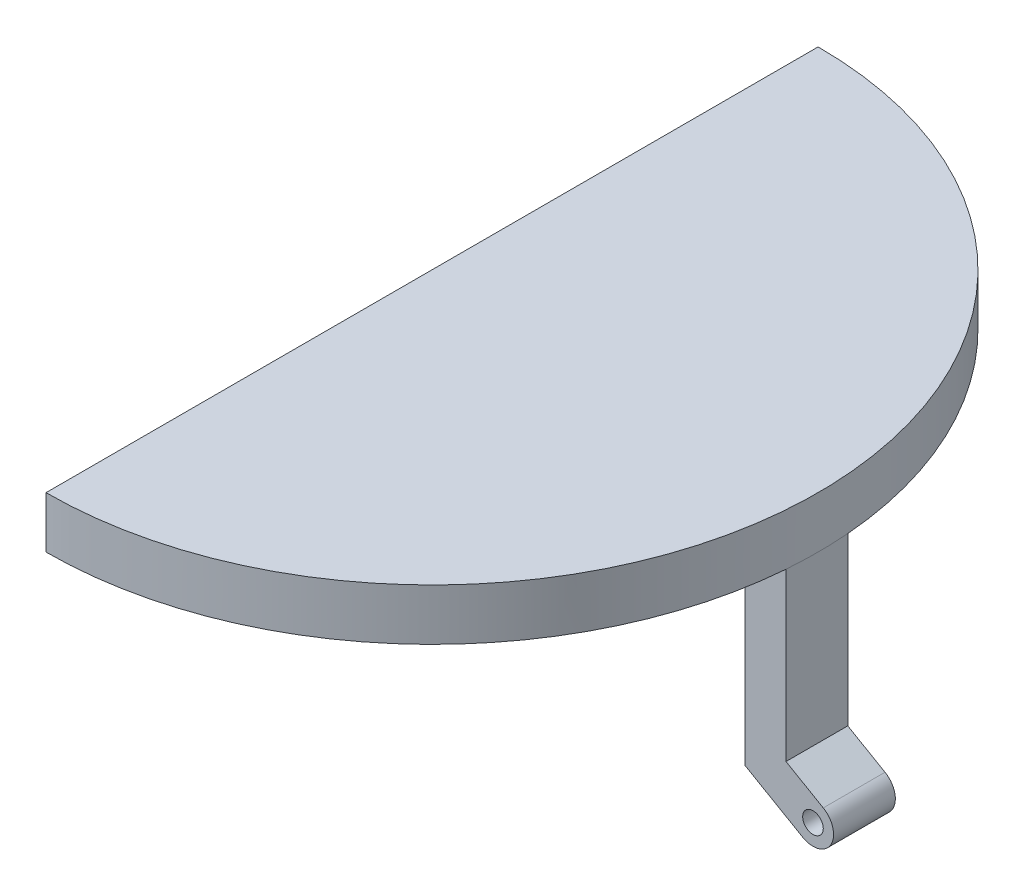
ISO-10303-21;
HEADER;
FILE_DESCRIPTION(('STEP AP214'),'2;1');
FILE_NAME('part.step','',(''),(''),'','','');
FILE_SCHEMA(('AUTOMOTIVE_DESIGN { 1 0 10303 214 1 1 1 1 }'));
ENDSEC;
DATA;
#1=APPLICATION_CONTEXT('core data for automotive mechanical design processes');
#2=APPLICATION_PROTOCOL_DEFINITION('international standard','automotive_design',2000,#1);
#3=PRODUCT_CONTEXT('',#1,'mechanical');
#4=PRODUCT('Part','Part','',(#3));
#5=PRODUCT_RELATED_PRODUCT_CATEGORY('part','',(#4));
#6=PRODUCT_DEFINITION_FORMATION('','',#4);
#7=PRODUCT_DEFINITION_CONTEXT('part definition',#1,'design');
#8=PRODUCT_DEFINITION('design','',#6,#7);
#9=PRODUCT_DEFINITION_SHAPE('','',#8);
#10=(LENGTH_UNIT() NAMED_UNIT(*) SI_UNIT(.MILLI.,.METRE.));
#11=(NAMED_UNIT(*) PLANE_ANGLE_UNIT() SI_UNIT($,.RADIAN.));
#12=(NAMED_UNIT(*) SI_UNIT($,.STERADIAN.) SOLID_ANGLE_UNIT());
#13=UNCERTAINTY_MEASURE_WITH_UNIT(LENGTH_MEASURE(1.E-05),#10,'distance_accuracy_value','');
#14=(GEOMETRIC_REPRESENTATION_CONTEXT(3) GLOBAL_UNCERTAINTY_ASSIGNED_CONTEXT((#13)) GLOBAL_UNIT_ASSIGNED_CONTEXT((#10,
#11,#12)) REPRESENTATION_CONTEXT('',''));
#15=CARTESIAN_POINT('',(0.,0.,0.));
#16=DIRECTION('',(0.,0.,1.));
#17=DIRECTION('',(1.,0.,0.));
#18=AXIS2_PLACEMENT_3D('',#15,#16,#17);
#19=CARTESIAN_POINT('',(0.,0.,37.5));
#20=DIRECTION('',(0.,1.,0.));
#21=DIRECTION('',(0.,0.,1.));
#22=AXIS2_PLACEMENT_3D('',#19,#20,#21);
#23=PLANE('',#22);
#24=DIRECTION('',(0.,0.,1.));
#25=VECTOR('',#24,1.);
#26=CARTESIAN_POINT('',(37.3798073831313,0.,34.5));
#27=LINE('',#26,#25);
#28=CARTESIAN_POINT('',(37.3798073831313,0.,34.5));
#29=VERTEX_POINT('',#28);
#30=CARTESIAN_POINT('',(37.3798073831313,0.,40.5));
#31=VERTEX_POINT('',#30);
#32=EDGE_CURVE('E89',#29,#31,#27,.T.);
#33=ORIENTED_EDGE('',*,*,#32,.F.);
#34=CARTESIAN_POINT('',(0.,0.,37.5));
#35=DIRECTION('',(0.,1.,0.));
#36=DIRECTION('',(0.,0.,1.));
#37=AXIS2_PLACEMENT_3D('',#34,#35,#36);
#38=CIRCLE('',#37,37.5);
#39=EDGE_CURVE('E85',#31,#29,#38,.T.);
#40=ORIENTED_EDGE('',*,*,#39,.F.);
#41=EDGE_LOOP('',(#33,#40));
#42=FACE_BOUND('',#41,.T.);
#43=ADVANCED_FACE('F32',(#42),#23,.F.);
#44=CARTESIAN_POINT('',(0.,5.,37.5));
#45=DIRECTION('',(0.,-1.,0.));
#46=DIRECTION('',(0.,0.,-1.));
#47=AXIS2_PLACEMENT_3D('',#44,#45,#46);
#48=CYLINDRICAL_SURFACE('',#47,37.5);
#49=CARTESIAN_POINT('',(0.,0.,75.));
#50=VERTEX_POINT('',#49);
#51=EDGE_CURVE('E76',#50,#31,#38,.T.);
#52=ORIENTED_EDGE('',*,*,#51,.T.);
#53=ORIENTED_EDGE('',*,*,#39,.T.);
#54=CARTESIAN_POINT('',(0.,0.,0.));
#55=VERTEX_POINT('',#54);
#56=EDGE_CURVE('E87',#29,#55,#38,.T.);
#57=ORIENTED_EDGE('',*,*,#56,.T.);
#58=DIRECTION('',(0.,-1.,0.));
#59=VECTOR('',#58,1.);
#60=CARTESIAN_POINT('',(0.,5.,0.));
#61=LINE('',#60,#59);
#62=CARTESIAN_POINT('',(0.,5.,0.));
#63=VERTEX_POINT('',#62);
#64=EDGE_CURVE('E11',#63,#55,#61,.T.);
#65=ORIENTED_EDGE('',*,*,#64,.F.);
#66=CARTESIAN_POINT('',(0.,5.,37.5));
#67=DIRECTION('',(0.,1.,0.));
#68=DIRECTION('',(0.,0.,1.));
#69=AXIS2_PLACEMENT_3D('',#66,#67,#68);
#70=CIRCLE('',#69,37.5);
#71=CARTESIAN_POINT('',(0.,5.,75.));
#72=VERTEX_POINT('',#71);
#73=EDGE_CURVE('E75',#72,#63,#70,.T.);
#74=ORIENTED_EDGE('',*,*,#73,.F.);
#75=DIRECTION('',(0.,-1.,0.));
#76=VECTOR('',#75,1.);
#77=CARTESIAN_POINT('',(0.,5.,75.));
#78=LINE('',#77,#76);
#79=EDGE_CURVE('E40',#72,#50,#78,.T.);
#80=ORIENTED_EDGE('',*,*,#79,.T.);
#81=EDGE_LOOP('',(#52,#53,#57,#65,#74,#80));
#82=FACE_BOUND('',#81,.T.);
#83=ADVANCED_FACE('F34',(#82),#48,.T.);
#84=CARTESIAN_POINT('',(0.,5.,0.));
#85=DIRECTION('',(1.,0.,0.));
#86=DIRECTION('',(0.,0.,-1.));
#87=AXIS2_PLACEMENT_3D('',#84,#85,#86);
#88=PLANE('',#87);
#89=DIRECTION('',(0.,0.,1.));
#90=VECTOR('',#89,1.);
#91=CARTESIAN_POINT('',(0.,0.,0.));
#92=LINE('',#91,#90);
#93=EDGE_CURVE('E67',#55,#50,#92,.T.);
#94=ORIENTED_EDGE('',*,*,#93,.T.);
#95=ORIENTED_EDGE('',*,*,#79,.F.);
#96=DIRECTION('',(0.,0.,1.));
#97=VECTOR('',#96,1.);
#98=CARTESIAN_POINT('',(0.,5.,0.));
#99=LINE('',#98,#97);
#100=EDGE_CURVE('E55',#63,#72,#99,.T.);
#101=ORIENTED_EDGE('',*,*,#100,.F.);
#102=ORIENTED_EDGE('',*,*,#64,.T.);
#103=EDGE_LOOP('',(#94,#95,#101,#102));
#104=FACE_BOUND('',#103,.T.);
#105=ADVANCED_FACE('F69',(#104),#88,.F.);
#106=CARTESIAN_POINT('',(0.,5.,37.5));
#107=DIRECTION('',(0.,1.,0.));
#108=DIRECTION('',(0.,0.,1.));
#109=AXIS2_PLACEMENT_3D('',#106,#107,#108);
#110=PLANE('',#109);
#111=ORIENTED_EDGE('',*,*,#73,.T.);
#112=ORIENTED_EDGE('',*,*,#100,.T.);
#113=EDGE_LOOP('',(#111,#112));
#114=FACE_BOUND('',#113,.T.);
#115=ADVANCED_FACE('F102',(#114),#110,.T.);
#116=DIRECTION('',(0.,0.,1.));
#117=VECTOR('',#116,1.);
#118=CARTESIAN_POINT('',(33.3798073831313,0.,34.5));
#119=LINE('',#118,#117);
#120=CARTESIAN_POINT('',(33.3798073831313,0.,34.5));
#121=VERTEX_POINT('',#120);
#122=CARTESIAN_POINT('',(33.3798073831313,0.,40.5));
#123=VERTEX_POINT('',#122);
#124=EDGE_CURVE('E125',#121,#123,#119,.T.);
#125=ORIENTED_EDGE('',*,*,#124,.T.);
#126=DIRECTION('',(1.,0.,0.));
#127=VECTOR('',#126,1.);
#128=CARTESIAN_POINT('',(33.3798073831313,0.,40.5));
#129=LINE('',#128,#127);
#130=EDGE_CURVE('E47',#123,#31,#129,.T.);
#131=ORIENTED_EDGE('',*,*,#130,.T.);
#132=ORIENTED_EDGE('',*,*,#51,.F.);
#133=ORIENTED_EDGE('',*,*,#93,.F.);
#134=ORIENTED_EDGE('',*,*,#56,.F.);
#135=DIRECTION('',(1.,0.,0.));
#136=VECTOR('',#135,1.);
#137=CARTESIAN_POINT('',(33.3798073831313,0.,34.5));
#138=LINE('',#137,#136);
#139=EDGE_CURVE('E123',#121,#29,#138,.T.);
#140=ORIENTED_EDGE('',*,*,#139,.F.);
#141=EDGE_LOOP('',(#125,#131,#132,#133,#134,#140));
#142=FACE_BOUND('',#141,.T.);
#143=ADVANCED_FACE('F83',(#142),#23,.F.);
#144=CARTESIAN_POINT('',(37.3798073831313,0.,34.5));
#145=DIRECTION('',(-1.,0.,0.));
#146=DIRECTION('',(0.,0.,1.));
#147=AXIS2_PLACEMENT_3D('',#144,#145,#146);
#148=PLANE('',#147);
#149=DIRECTION('',(0.,-1.,0.));
#150=VECTOR('',#149,1.);
#151=CARTESIAN_POINT('',(37.3798073831313,0.,40.5));
#152=LINE('',#151,#150);
#153=CARTESIAN_POINT('',(37.3798073831313,-16.1778300105637,40.5));
#154=VERTEX_POINT('',#153);
#155=EDGE_CURVE('E153',#31,#154,#152,.T.);
#156=ORIENTED_EDGE('',*,*,#155,.T.);
#157=DIRECTION('',(0.,0.,1.));
#158=VECTOR('',#157,1.);
#159=CARTESIAN_POINT('',(37.3798073831313,-16.1778300105637,34.5));
#160=LINE('',#159,#158);
#161=CARTESIAN_POINT('',(37.3798073831313,-16.1778300105637,34.5));
#162=VERTEX_POINT('',#161);
#163=EDGE_CURVE('E91',#162,#154,#160,.T.);
#164=ORIENTED_EDGE('',*,*,#163,.F.);
#165=DIRECTION('',(0.,-1.,0.));
#166=VECTOR('',#165,1.);
#167=CARTESIAN_POINT('',(37.3798073831313,0.,34.5));
#168=LINE('',#167,#166);
#169=EDGE_CURVE('E131',#29,#162,#168,.T.);
#170=ORIENTED_EDGE('',*,*,#169,.F.);
#171=ORIENTED_EDGE('',*,*,#32,.T.);
#172=EDGE_LOOP('',(#156,#164,#170,#171));
#173=FACE_BOUND('',#172,.T.);
#174=ADVANCED_FACE('F109',(#173),#148,.F.);
#175=CARTESIAN_POINT('',(37.3798073831313,-16.1778300105637,34.5));
#176=DIRECTION('',(-0.499999999999998,-0.86602540378444,0.));
#177=DIRECTION('',(0.86602540378444,-0.499999999999998,0.));
#178=AXIS2_PLACEMENT_3D('',#175,#176,#177);
#179=PLANE('',#178);
#180=DIRECTION('',(0.86602540378444,-0.499999999999998,0.));
#181=VECTOR('',#180,1.);
#182=CARTESIAN_POINT('',(37.3798073831313,-16.1778300105637,40.5));
#183=LINE('',#182,#181);
#184=CARTESIAN_POINT('',(41.,-18.2679491924311,40.5));
#185=VERTEX_POINT('',#184);
#186=EDGE_CURVE('E155',#154,#185,#183,.T.);
#187=ORIENTED_EDGE('',*,*,#186,.T.);
#188=DIRECTION('',(0.,0.,1.));
#189=VECTOR('',#188,1.);
#190=CARTESIAN_POINT('',(41.,-18.2679491924311,34.5));
#191=LINE('',#190,#189);
#192=CARTESIAN_POINT('',(41.,-18.2679491924311,34.5));
#193=VERTEX_POINT('',#192);
#194=EDGE_CURVE('E98',#193,#185,#191,.T.);
#195=ORIENTED_EDGE('',*,*,#194,.F.);
#196=DIRECTION('',(0.86602540378444,-0.499999999999998,0.));
#197=VECTOR('',#196,1.);
#198=CARTESIAN_POINT('',(37.3798073831313,-16.1778300105637,34.5));
#199=LINE('',#198,#197);
#200=EDGE_CURVE('E134',#162,#193,#199,.T.);
#201=ORIENTED_EDGE('',*,*,#200,.F.);
#202=ORIENTED_EDGE('',*,*,#163,.T.);
#203=EDGE_LOOP('',(#187,#195,#201,#202));
#204=FACE_BOUND('',#203,.T.);
#205=ADVANCED_FACE('F184',(#204),#179,.F.);
#206=CARTESIAN_POINT('',(40.,-20.,34.5));
#207=DIRECTION('',(0.,0.,1.));
#208=DIRECTION('',(1.,0.,0.));
#209=AXIS2_PLACEMENT_3D('',#206,#207,#208);
#210=CYLINDRICAL_SURFACE('',#209,2.);
#211=CARTESIAN_POINT('',(40.,-20.,40.5));
#212=DIRECTION('',(0.,0.,1.));
#213=DIRECTION('',(1.,0.,0.));
#214=AXIS2_PLACEMENT_3D('',#211,#212,#213);
#215=CIRCLE('',#214,2.);
#216=CARTESIAN_POINT('',(39.,-21.7320508075689,40.5));
#217=VERTEX_POINT('',#216);
#218=EDGE_CURVE('E158',#217,#185,#215,.T.);
#219=ORIENTED_EDGE('',*,*,#218,.F.);
#220=DIRECTION('',(0.,0.,1.));
#221=VECTOR('',#220,1.);
#222=CARTESIAN_POINT('',(39.,-21.7320508075689,34.5));
#223=LINE('',#222,#221);
#224=CARTESIAN_POINT('',(39.,-21.7320508075689,34.5));
#225=VERTEX_POINT('',#224);
#226=EDGE_CURVE('E167',#225,#217,#223,.T.);
#227=ORIENTED_EDGE('',*,*,#226,.F.);
#228=CARTESIAN_POINT('',(40.,-20.,34.5));
#229=DIRECTION('',(0.,0.,1.));
#230=DIRECTION('',(1.,0.,0.));
#231=AXIS2_PLACEMENT_3D('',#228,#229,#230);
#232=CIRCLE('',#231,2.);
#233=EDGE_CURVE('E144',#225,#193,#232,.T.);
#234=ORIENTED_EDGE('',*,*,#233,.T.);
#235=ORIENTED_EDGE('',*,*,#194,.T.);
#236=EDGE_LOOP('',(#219,#227,#234,#235));
#237=FACE_BOUND('',#236,.T.);
#238=ADVANCED_FACE('F174',(#237),#210,.T.);
#239=CARTESIAN_POINT('',(39.,-21.7320508075689,34.5));
#240=DIRECTION('',(0.499999999999998,0.86602540378444,0.));
#241=DIRECTION('',(-0.86602540378444,0.499999999999998,0.));
#242=AXIS2_PLACEMENT_3D('',#239,#240,#241);
#243=PLANE('',#242);
#244=DIRECTION('',(-0.86602540378444,0.499999999999998,0.));
#245=VECTOR('',#244,1.);
#246=CARTESIAN_POINT('',(39.,-21.7320508075689,40.5));
#247=LINE('',#246,#245);
#248=CARTESIAN_POINT('',(33.3798073831313,-18.4872310873222,40.5));
#249=VERTEX_POINT('',#248);
#250=EDGE_CURVE('E136',#217,#249,#247,.T.);
#251=ORIENTED_EDGE('',*,*,#250,.T.);
#252=DIRECTION('',(0.,0.,1.));
#253=VECTOR('',#252,1.);
#254=CARTESIAN_POINT('',(33.3798073831313,-18.4872310873222,34.5));
#255=LINE('',#254,#253);
#256=CARTESIAN_POINT('',(33.3798073831313,-18.4872310873222,34.5));
#257=VERTEX_POINT('',#256);
#258=EDGE_CURVE('E164',#257,#249,#255,.T.);
#259=ORIENTED_EDGE('',*,*,#258,.F.);
#260=DIRECTION('',(-0.86602540378444,0.499999999999998,0.));
#261=VECTOR('',#260,1.);
#262=CARTESIAN_POINT('',(39.,-21.7320508075689,34.5));
#263=LINE('',#262,#261);
#264=EDGE_CURVE('E147',#225,#257,#263,.T.);
#265=ORIENTED_EDGE('',*,*,#264,.F.);
#266=ORIENTED_EDGE('',*,*,#226,.T.);
#267=EDGE_LOOP('',(#251,#259,#265,#266));
#268=FACE_BOUND('',#267,.T.);
#269=ADVANCED_FACE('F191',(#268),#243,.F.);
#270=CARTESIAN_POINT('',(33.3798073831313,-18.4872310873222,34.5));
#271=DIRECTION('',(1.,0.,0.));
#272=DIRECTION('',(0.,0.,-1.));
#273=AXIS2_PLACEMENT_3D('',#270,#271,#272);
#274=PLANE('',#273);
#275=DIRECTION('',(0.,1.,0.));
#276=VECTOR('',#275,1.);
#277=CARTESIAN_POINT('',(33.3798073831313,-18.4872310873222,40.5));
#278=LINE('',#277,#276);
#279=EDGE_CURVE('E132',#249,#123,#278,.T.);
#280=ORIENTED_EDGE('',*,*,#279,.T.);
#281=ORIENTED_EDGE('',*,*,#124,.F.);
#282=DIRECTION('',(0.,1.,0.));
#283=VECTOR('',#282,1.);
#284=CARTESIAN_POINT('',(33.3798073831313,-18.4872310873222,34.5));
#285=LINE('',#284,#283);
#286=EDGE_CURVE('E150',#257,#121,#285,.T.);
#287=ORIENTED_EDGE('',*,*,#286,.F.);
#288=ORIENTED_EDGE('',*,*,#258,.T.);
#289=EDGE_LOOP('',(#280,#281,#287,#288));
#290=FACE_BOUND('',#289,.T.);
#291=ADVANCED_FACE('F195',(#290),#274,.F.);
#292=CARTESIAN_POINT('',(40.,-20.,34.5));
#293=DIRECTION('',(0.,0.,1.));
#294=DIRECTION('',(1.,0.,0.));
#295=AXIS2_PLACEMENT_3D('',#292,#293,#294);
#296=PLANE('',#295);
#297=CARTESIAN_POINT('',(40.,-20.,34.5));
#298=DIRECTION('',(0.,0.,1.));
#299=DIRECTION('',(1.,0.,0.));
#300=AXIS2_PLACEMENT_3D('',#297,#298,#299);
#301=CIRCLE('',#300,0.999999999999998);
#302=CARTESIAN_POINT('',(41.,-20.,34.5));
#303=VERTEX_POINT('',#302);
#304=EDGE_CURVE('E139',#303,#303,#301,.F.);
#305=ORIENTED_EDGE('',*,*,#304,.F.);
#306=EDGE_LOOP('',(#305));
#307=FACE_BOUND('',#306,.T.);
#308=ORIENTED_EDGE('',*,*,#139,.T.);
#309=ORIENTED_EDGE('',*,*,#169,.T.);
#310=ORIENTED_EDGE('',*,*,#200,.T.);
#311=ORIENTED_EDGE('',*,*,#233,.F.);
#312=ORIENTED_EDGE('',*,*,#264,.T.);
#313=ORIENTED_EDGE('',*,*,#286,.T.);
#314=EDGE_LOOP('',(#308,#309,#310,#311,#312,#313));
#315=FACE_BOUND('',#314,.T.);
#316=ADVANCED_FACE('F198',(#307,#315),#296,.F.);
#317=CARTESIAN_POINT('',(40.,-20.,40.5));
#318=DIRECTION('',(0.,0.,1.));
#319=DIRECTION('',(1.,0.,0.));
#320=AXIS2_PLACEMENT_3D('',#317,#318,#319);
#321=PLANE('',#320);
#322=CARTESIAN_POINT('',(40.,-20.,40.5));
#323=DIRECTION('',(0.,0.,1.));
#324=DIRECTION('',(1.,0.,0.));
#325=AXIS2_PLACEMENT_3D('',#322,#323,#324);
#326=CIRCLE('',#325,0.999999999999998);
#327=CARTESIAN_POINT('',(41.,-20.,40.5));
#328=VERTEX_POINT('',#327);
#329=EDGE_CURVE('E232',#328,#328,#326,.T.);
#330=ORIENTED_EDGE('',*,*,#329,.F.);
#331=EDGE_LOOP('',(#330));
#332=FACE_BOUND('',#331,.T.);
#333=ORIENTED_EDGE('',*,*,#130,.F.);
#334=ORIENTED_EDGE('',*,*,#279,.F.);
#335=ORIENTED_EDGE('',*,*,#250,.F.);
#336=ORIENTED_EDGE('',*,*,#218,.T.);
#337=ORIENTED_EDGE('',*,*,#186,.F.);
#338=ORIENTED_EDGE('',*,*,#155,.F.);
#339=EDGE_LOOP('',(#333,#334,#335,#336,#337,#338));
#340=FACE_BOUND('',#339,.T.);
#341=ADVANCED_FACE('F187',(#332,#340),#321,.T.);
#342=CARTESIAN_POINT('',(40.,-20.,31.6715728752538));
#343=DIRECTION('',(0.,0.,1.));
#344=DIRECTION('',(1.,0.,0.));
#345=AXIS2_PLACEMENT_3D('',#342,#343,#344);
#346=CYLINDRICAL_SURFACE('',#345,0.999999999999998);
#347=ORIENTED_EDGE('',*,*,#304,.T.);
#348=EDGE_LOOP('',(#347));
#349=FACE_BOUND('',#348,.T.);
#350=ORIENTED_EDGE('',*,*,#329,.T.);
#351=EDGE_LOOP('',(#350));
#352=FACE_BOUND('',#351,.T.);
#353=ADVANCED_FACE('F218',(#349,#352),#346,.F.);
#354=CLOSED_SHELL('',(#43,#83,#105,#115,#143,#174,#205,#238,#269,#291,#316,#341,#353));
#355=MANIFOLD_SOLID_BREP('B2',#354);
#356=ADVANCED_BREP_SHAPE_REPRESENTATION('',(#18,#355),#14);
#357=SHAPE_DEFINITION_REPRESENTATION(#9,#356);
ENDSEC;
END-ISO-10303-21;
